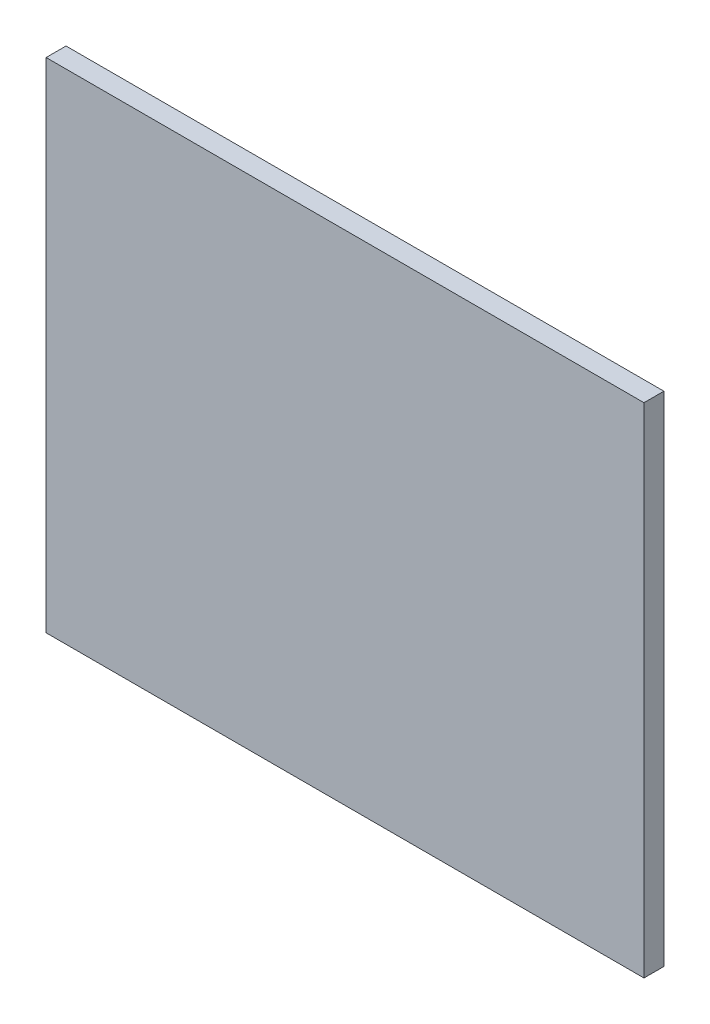
ISO-10303-21;
HEADER;
FILE_DESCRIPTION(('STEP AP214'),'2;1');
FILE_NAME('part.step','',(''),(''),'','','');
FILE_SCHEMA(('AUTOMOTIVE_DESIGN { 1 0 10303 214 1 1 1 1 }'));
ENDSEC;
DATA;
#1=APPLICATION_CONTEXT('core data for automotive mechanical design processes');
#2=APPLICATION_PROTOCOL_DEFINITION('international standard','automotive_design',2000,#1);
#3=PRODUCT_CONTEXT('',#1,'mechanical');
#4=PRODUCT('Part','Part','',(#3));
#5=PRODUCT_RELATED_PRODUCT_CATEGORY('part','',(#4));
#6=PRODUCT_DEFINITION_FORMATION('','',#4);
#7=PRODUCT_DEFINITION_CONTEXT('part definition',#1,'design');
#8=PRODUCT_DEFINITION('design','',#6,#7);
#9=PRODUCT_DEFINITION_SHAPE('','',#8);
#10=(LENGTH_UNIT() NAMED_UNIT(*) SI_UNIT(.MILLI.,.METRE.));
#11=(NAMED_UNIT(*) PLANE_ANGLE_UNIT() SI_UNIT($,.RADIAN.));
#12=(NAMED_UNIT(*) SI_UNIT($,.STERADIAN.) SOLID_ANGLE_UNIT());
#13=UNCERTAINTY_MEASURE_WITH_UNIT(LENGTH_MEASURE(1.E-05),#10,'distance_accuracy_value','');
#14=(GEOMETRIC_REPRESENTATION_CONTEXT(3) GLOBAL_UNCERTAINTY_ASSIGNED_CONTEXT((#13)) GLOBAL_UNIT_ASSIGNED_CONTEXT((#10,
#11,#12)) REPRESENTATION_CONTEXT('',''));
#15=CARTESIAN_POINT('',(0.,0.,0.));
#16=DIRECTION('',(0.,0.,1.));
#17=DIRECTION('',(1.,0.,0.));
#18=AXIS2_PLACEMENT_3D('',#15,#16,#17);
#19=CARTESIAN_POINT('',(-0.3,-0.25,0.33));
#20=DIRECTION('',(1.,0.,0.));
#21=DIRECTION('',(0.,0.,1.));
#22=AXIS2_PLACEMENT_3D('',#19,#20,#21);
#23=PLANE('',#22);
#24=DIRECTION('',(0.,1.,0.));
#25=VECTOR('',#24,1.);
#26=CARTESIAN_POINT('',(-0.3,-0.25,0.35));
#27=LINE('',#26,#25);
#28=CARTESIAN_POINT('',(-0.3,-0.25,0.35));
#29=VERTEX_POINT('',#28);
#30=CARTESIAN_POINT('',(-0.3,0.25,0.35));
#31=VERTEX_POINT('',#30);
#32=EDGE_CURVE('E11',#29,#31,#27,.T.);
#33=ORIENTED_EDGE('',*,*,#32,.T.);
#34=DIRECTION('',(0.,0.,1.));
#35=VECTOR('',#34,1.);
#36=CARTESIAN_POINT('',(-0.3,0.25,0.33));
#37=LINE('',#36,#35);
#38=CARTESIAN_POINT('',(-0.3,0.25,0.33));
#39=VERTEX_POINT('',#38);
#40=EDGE_CURVE('E24',#39,#31,#37,.T.);
#41=ORIENTED_EDGE('',*,*,#40,.F.);
#42=DIRECTION('',(0.,1.,0.));
#43=VECTOR('',#42,1.);
#44=CARTESIAN_POINT('',(-0.3,-0.25,0.33));
#45=LINE('',#44,#43);
#46=CARTESIAN_POINT('',(-0.3,-0.25,0.33));
#47=VERTEX_POINT('',#46);
#48=EDGE_CURVE('E62',#47,#39,#45,.T.);
#49=ORIENTED_EDGE('',*,*,#48,.F.);
#50=DIRECTION('',(0.,0.,1.));
#51=VECTOR('',#50,1.);
#52=CARTESIAN_POINT('',(-0.3,-0.25,0.33));
#53=LINE('',#52,#51);
#54=EDGE_CURVE('E36',#47,#29,#53,.T.);
#55=ORIENTED_EDGE('',*,*,#54,.T.);
#56=EDGE_LOOP('',(#33,#41,#49,#55));
#57=FACE_BOUND('',#56,.T.);
#58=ADVANCED_FACE('F17',(#57),#23,.F.);
#59=CARTESIAN_POINT('',(-0.3,-0.25,0.33));
#60=DIRECTION('',(0.,1.,0.));
#61=DIRECTION('',(0.,0.,1.));
#62=AXIS2_PLACEMENT_3D('',#59,#60,#61);
#63=PLANE('',#62);
#64=DIRECTION('',(0.,0.,1.));
#65=VECTOR('',#64,1.);
#66=CARTESIAN_POINT('',(0.3,-0.25,0.33));
#67=LINE('',#66,#65);
#68=CARTESIAN_POINT('',(0.3,-0.25,0.33));
#69=VERTEX_POINT('',#68);
#70=CARTESIAN_POINT('',(0.3,-0.25,0.35));
#71=VERTEX_POINT('',#70);
#72=EDGE_CURVE('E75',#69,#71,#67,.T.);
#73=ORIENTED_EDGE('',*,*,#72,.T.);
#74=DIRECTION('',(1.,0.,0.));
#75=VECTOR('',#74,1.);
#76=CARTESIAN_POINT('',(-0.3,-0.25,0.35));
#77=LINE('',#76,#75);
#78=EDGE_CURVE('E83',#29,#71,#77,.T.);
#79=ORIENTED_EDGE('',*,*,#78,.F.);
#80=ORIENTED_EDGE('',*,*,#54,.F.);
#81=DIRECTION('',(1.,0.,0.));
#82=VECTOR('',#81,1.);
#83=CARTESIAN_POINT('',(-0.3,-0.25,0.33));
#84=LINE('',#83,#82);
#85=EDGE_CURVE('E81',#47,#69,#84,.T.);
#86=ORIENTED_EDGE('',*,*,#85,.T.);
#87=EDGE_LOOP('',(#73,#79,#80,#86));
#88=FACE_BOUND('',#87,.T.);
#89=ADVANCED_FACE('F89',(#88),#63,.F.);
#90=CARTESIAN_POINT('',(-0.3,-0.25,0.35));
#91=DIRECTION('',(0.,0.,1.));
#92=DIRECTION('',(1.,0.,0.));
#93=AXIS2_PLACEMENT_3D('',#90,#91,#92);
#94=PLANE('',#93);
#95=ORIENTED_EDGE('',*,*,#32,.F.);
#96=ORIENTED_EDGE('',*,*,#78,.T.);
#97=DIRECTION('',(0.,1.,0.));
#98=VECTOR('',#97,1.);
#99=CARTESIAN_POINT('',(0.3,-0.25,0.35));
#100=LINE('',#99,#98);
#101=CARTESIAN_POINT('',(0.3,0.25,0.35));
#102=VERTEX_POINT('',#101);
#103=EDGE_CURVE('E79',#71,#102,#100,.T.);
#104=ORIENTED_EDGE('',*,*,#103,.T.);
#105=DIRECTION('',(1.,0.,0.));
#106=VECTOR('',#105,1.);
#107=CARTESIAN_POINT('',(-0.3,0.25,0.35));
#108=LINE('',#107,#106);
#109=EDGE_CURVE('E63',#31,#102,#108,.T.);
#110=ORIENTED_EDGE('',*,*,#109,.F.);
#111=EDGE_LOOP('',(#95,#96,#104,#110));
#112=FACE_BOUND('',#111,.T.);
#113=ADVANCED_FACE('F91',(#112),#94,.T.);
#114=CARTESIAN_POINT('',(-0.3,0.25,0.33));
#115=DIRECTION('',(0.,1.,0.));
#116=DIRECTION('',(0.,0.,1.));
#117=AXIS2_PLACEMENT_3D('',#114,#115,#116);
#118=PLANE('',#117);
#119=DIRECTION('',(1.,0.,0.));
#120=VECTOR('',#119,1.);
#121=CARTESIAN_POINT('',(-0.3,0.25,0.33));
#122=LINE('',#121,#120);
#123=CARTESIAN_POINT('',(0.3,0.25,0.33));
#124=VERTEX_POINT('',#123);
#125=EDGE_CURVE('E56',#39,#124,#122,.T.);
#126=ORIENTED_EDGE('',*,*,#125,.F.);
#127=ORIENTED_EDGE('',*,*,#40,.T.);
#128=ORIENTED_EDGE('',*,*,#109,.T.);
#129=DIRECTION('',(0.,0.,1.));
#130=VECTOR('',#129,1.);
#131=CARTESIAN_POINT('',(0.3,0.25,0.33));
#132=LINE('',#131,#130);
#133=EDGE_CURVE('E64',#124,#102,#132,.T.);
#134=ORIENTED_EDGE('',*,*,#133,.F.);
#135=EDGE_LOOP('',(#126,#127,#128,#134));
#136=FACE_BOUND('',#135,.T.);
#137=ADVANCED_FACE('F67',(#136),#118,.T.);
#138=CARTESIAN_POINT('',(-0.3,-0.25,0.33));
#139=DIRECTION('',(0.,0.,1.));
#140=DIRECTION('',(1.,0.,0.));
#141=AXIS2_PLACEMENT_3D('',#138,#139,#140);
#142=PLANE('',#141);
#143=ORIENTED_EDGE('',*,*,#125,.T.);
#144=DIRECTION('',(0.,1.,0.));
#145=VECTOR('',#144,1.);
#146=CARTESIAN_POINT('',(0.3,-0.25,0.33));
#147=LINE('',#146,#145);
#148=EDGE_CURVE('E61',#69,#124,#147,.T.);
#149=ORIENTED_EDGE('',*,*,#148,.F.);
#150=ORIENTED_EDGE('',*,*,#85,.F.);
#151=ORIENTED_EDGE('',*,*,#48,.T.);
#152=EDGE_LOOP('',(#143,#149,#150,#151));
#153=FACE_BOUND('',#152,.T.);
#154=ADVANCED_FACE('F58',(#153),#142,.F.);
#155=CARTESIAN_POINT('',(0.3,-0.25,0.33));
#156=DIRECTION('',(1.,0.,0.));
#157=DIRECTION('',(0.,0.,1.));
#158=AXIS2_PLACEMENT_3D('',#155,#156,#157);
#159=PLANE('',#158);
#160=ORIENTED_EDGE('',*,*,#72,.F.);
#161=ORIENTED_EDGE('',*,*,#148,.T.);
#162=ORIENTED_EDGE('',*,*,#133,.T.);
#163=ORIENTED_EDGE('',*,*,#103,.F.);
#164=EDGE_LOOP('',(#160,#161,#162,#163));
#165=FACE_BOUND('',#164,.T.);
#166=ADVANCED_FACE('F73',(#165),#159,.T.);
#167=CLOSED_SHELL('',(#58,#89,#113,#137,#154,#166));
#168=MANIFOLD_SOLID_BREP('B1',#167);
#169=ADVANCED_BREP_SHAPE_REPRESENTATION('',(#18,#168),#14);
#170=SHAPE_DEFINITION_REPRESENTATION(#9,#169);
ENDSEC;
END-ISO-10303-21;
